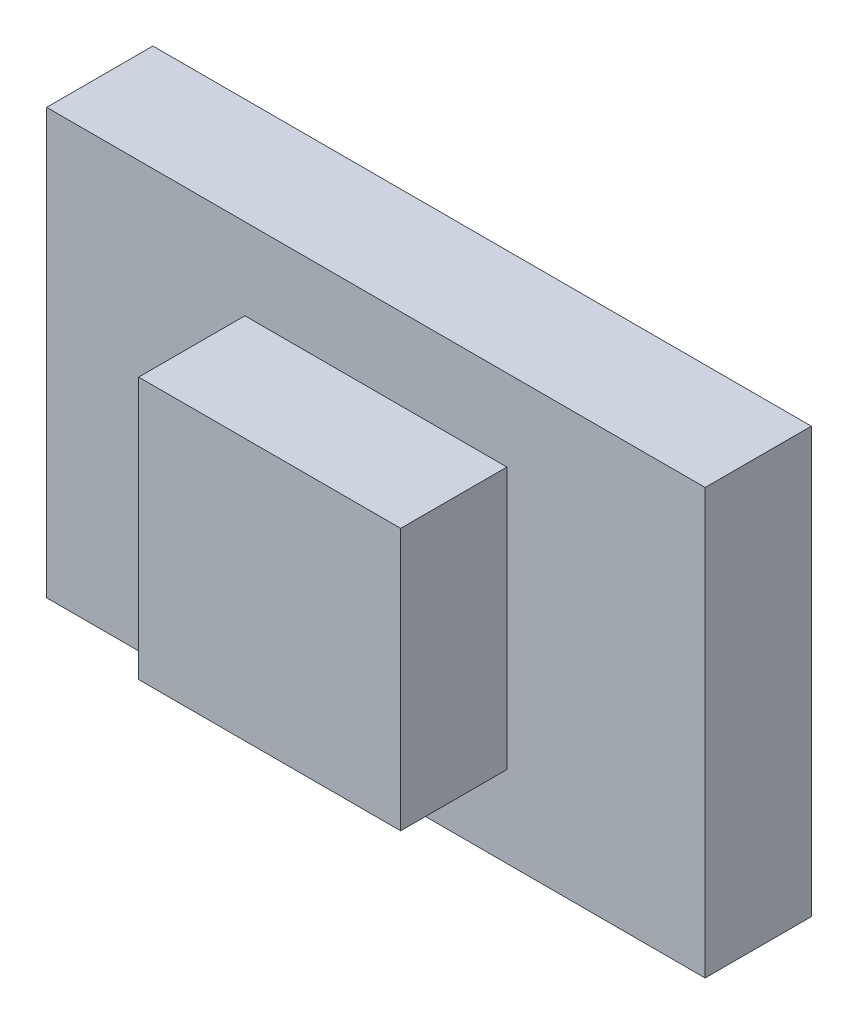
ISO-10303-21;
HEADER;
FILE_DESCRIPTION(('STEP AP214'),'2;1');
FILE_NAME('part.step','',(''),(''),'','','');
FILE_SCHEMA(('AUTOMOTIVE_DESIGN { 1 0 10303 214 1 1 1 1 }'));
ENDSEC;
DATA;
#1=APPLICATION_CONTEXT('core data for automotive mechanical design processes');
#2=APPLICATION_PROTOCOL_DEFINITION('international standard','automotive_design',2000,#1);
#3=PRODUCT_CONTEXT('',#1,'mechanical');
#4=PRODUCT('Part','Part','',(#3));
#5=PRODUCT_RELATED_PRODUCT_CATEGORY('part','',(#4));
#6=PRODUCT_DEFINITION_FORMATION('','',#4);
#7=PRODUCT_DEFINITION_CONTEXT('part definition',#1,'design');
#8=PRODUCT_DEFINITION('design','',#6,#7);
#9=PRODUCT_DEFINITION_SHAPE('','',#8);
#10=(LENGTH_UNIT() NAMED_UNIT(*) SI_UNIT(.MILLI.,.METRE.));
#11=(NAMED_UNIT(*) PLANE_ANGLE_UNIT() SI_UNIT($,.RADIAN.));
#12=(NAMED_UNIT(*) SI_UNIT($,.STERADIAN.) SOLID_ANGLE_UNIT());
#13=UNCERTAINTY_MEASURE_WITH_UNIT(LENGTH_MEASURE(1.E-05),#10,'distance_accuracy_value','');
#14=(GEOMETRIC_REPRESENTATION_CONTEXT(3) GLOBAL_UNCERTAINTY_ASSIGNED_CONTEXT((#13)) GLOBAL_UNIT_ASSIGNED_CONTEXT((#10,
#11,#12)) REPRESENTATION_CONTEXT('',''));
#15=CARTESIAN_POINT('',(0.,0.,0.));
#16=DIRECTION('',(0.,0.,1.));
#17=DIRECTION('',(1.,0.,0.));
#18=AXIS2_PLACEMENT_3D('',#15,#16,#17);
#19=CARTESIAN_POINT('',(46.5,-30.,15.));
#20=DIRECTION('',(0.,1.,0.));
#21=DIRECTION('',(0.,0.,1.));
#22=AXIS2_PLACEMENT_3D('',#19,#20,#21);
#23=PLANE('',#22);
#24=DIRECTION('',(1.,0.,0.));
#25=VECTOR('',#24,1.);
#26=CARTESIAN_POINT('',(46.5,-30.,0.));
#27=LINE('',#26,#25);
#28=CARTESIAN_POINT('',(-46.5,-30.,0.));
#29=VERTEX_POINT('',#28);
#30=CARTESIAN_POINT('',(46.5,-30.,0.));
#31=VERTEX_POINT('',#30);
#32=EDGE_CURVE('E137',#29,#31,#27,.T.);
#33=ORIENTED_EDGE('',*,*,#32,.T.);
#34=DIRECTION('',(0.,0.,-1.));
#35=VECTOR('',#34,1.);
#36=CARTESIAN_POINT('',(46.5,-30.,15.));
#37=LINE('',#36,#35);
#38=CARTESIAN_POINT('',(46.5,-30.,15.));
#39=VERTEX_POINT('',#38);
#40=EDGE_CURVE('E11',#39,#31,#37,.T.);
#41=ORIENTED_EDGE('',*,*,#40,.F.);
#42=DIRECTION('',(1.,0.,0.));
#43=VECTOR('',#42,1.);
#44=CARTESIAN_POINT('',(46.5,-30.,15.));
#45=LINE('',#44,#43);
#46=CARTESIAN_POINT('',(-46.5,-30.,15.));
#47=VERTEX_POINT('',#46);
#48=EDGE_CURVE('E148',#47,#39,#45,.T.);
#49=ORIENTED_EDGE('',*,*,#48,.F.);
#50=DIRECTION('',(0.,0.,-1.));
#51=VECTOR('',#50,1.);
#52=CARTESIAN_POINT('',(-46.5,-30.,15.));
#53=LINE('',#52,#51);
#54=EDGE_CURVE('E161',#47,#29,#53,.T.);
#55=ORIENTED_EDGE('',*,*,#54,.T.);
#56=EDGE_LOOP('',(#33,#41,#49,#55));
#57=FACE_BOUND('',#56,.T.);
#58=ADVANCED_FACE('F49',(#57),#23,.F.);
#59=CARTESIAN_POINT('',(46.5,30.,15.));
#60=DIRECTION('',(-1.,0.,0.));
#61=DIRECTION('',(0.,-1.,0.));
#62=AXIS2_PLACEMENT_3D('',#59,#60,#61);
#63=PLANE('',#62);
#64=DIRECTION('',(0.,1.,0.));
#65=VECTOR('',#64,1.);
#66=CARTESIAN_POINT('',(46.5,30.,0.));
#67=LINE('',#66,#65);
#68=CARTESIAN_POINT('',(46.5,30.,0.));
#69=VERTEX_POINT('',#68);
#70=EDGE_CURVE('E142',#31,#69,#67,.T.);
#71=ORIENTED_EDGE('',*,*,#70,.T.);
#72=DIRECTION('',(0.,0.,-1.));
#73=VECTOR('',#72,1.);
#74=CARTESIAN_POINT('',(46.5,30.,15.));
#75=LINE('',#74,#73);
#76=CARTESIAN_POINT('',(46.5,30.,15.));
#77=VERTEX_POINT('',#76);
#78=EDGE_CURVE('E57',#77,#69,#75,.T.);
#79=ORIENTED_EDGE('',*,*,#78,.F.);
#80=DIRECTION('',(0.,1.,0.));
#81=VECTOR('',#80,1.);
#82=CARTESIAN_POINT('',(46.5,30.,15.));
#83=LINE('',#82,#81);
#84=EDGE_CURVE('E152',#39,#77,#83,.T.);
#85=ORIENTED_EDGE('',*,*,#84,.F.);
#86=ORIENTED_EDGE('',*,*,#40,.T.);
#87=EDGE_LOOP('',(#71,#79,#85,#86));
#88=FACE_BOUND('',#87,.T.);
#89=ADVANCED_FACE('F198',(#88),#63,.F.);
#90=CARTESIAN_POINT('',(46.5,30.,15.));
#91=DIRECTION('',(0.,-1.,0.));
#92=DIRECTION('',(0.,0.,-1.));
#93=AXIS2_PLACEMENT_3D('',#90,#91,#92);
#94=PLANE('',#93);
#95=DIRECTION('',(-1.,0.,0.));
#96=VECTOR('',#95,1.);
#97=CARTESIAN_POINT('',(46.5,30.,0.));
#98=LINE('',#97,#96);
#99=CARTESIAN_POINT('',(-46.5,30.,0.));
#100=VERTEX_POINT('',#99);
#101=EDGE_CURVE('E165',#69,#100,#98,.T.);
#102=ORIENTED_EDGE('',*,*,#101,.T.);
#103=DIRECTION('',(0.,0.,-1.));
#104=VECTOR('',#103,1.);
#105=CARTESIAN_POINT('',(-46.5,30.,15.));
#106=LINE('',#105,#104);
#107=CARTESIAN_POINT('',(-46.5,30.,15.));
#108=VERTEX_POINT('',#107);
#109=EDGE_CURVE('E173',#108,#100,#106,.T.);
#110=ORIENTED_EDGE('',*,*,#109,.F.);
#111=DIRECTION('',(-1.,0.,0.));
#112=VECTOR('',#111,1.);
#113=CARTESIAN_POINT('',(46.5,30.,15.));
#114=LINE('',#113,#112);
#115=EDGE_CURVE('E156',#77,#108,#114,.T.);
#116=ORIENTED_EDGE('',*,*,#115,.F.);
#117=ORIENTED_EDGE('',*,*,#78,.T.);
#118=EDGE_LOOP('',(#102,#110,#116,#117));
#119=FACE_BOUND('',#118,.T.);
#120=ADVANCED_FACE('F182',(#119),#94,.F.);
#121=CARTESIAN_POINT('',(-46.5,30.,15.));
#122=DIRECTION('',(1.,0.,0.));
#123=DIRECTION('',(0.,0.,-1.));
#124=AXIS2_PLACEMENT_3D('',#121,#122,#123);
#125=PLANE('',#124);
#126=DIRECTION('',(0.,-1.,0.));
#127=VECTOR('',#126,1.);
#128=CARTESIAN_POINT('',(-46.5,30.,0.));
#129=LINE('',#128,#127);
#130=EDGE_CURVE('E153',#100,#29,#129,.T.);
#131=ORIENTED_EDGE('',*,*,#130,.T.);
#132=ORIENTED_EDGE('',*,*,#54,.F.);
#133=DIRECTION('',(0.,-1.,0.));
#134=VECTOR('',#133,1.);
#135=CARTESIAN_POINT('',(-46.5,30.,15.));
#136=LINE('',#135,#134);
#137=EDGE_CURVE('E159',#108,#47,#136,.T.);
#138=ORIENTED_EDGE('',*,*,#137,.F.);
#139=ORIENTED_EDGE('',*,*,#109,.T.);
#140=EDGE_LOOP('',(#131,#132,#138,#139));
#141=FACE_BOUND('',#140,.T.);
#142=ADVANCED_FACE('F191',(#141),#125,.F.);
#143=CARTESIAN_POINT('',(0.,0.,15.));
#144=DIRECTION('',(0.,0.,1.));
#145=DIRECTION('',(1.,0.,0.));
#146=AXIS2_PLACEMENT_3D('',#143,#144,#145);
#147=PLANE('',#146);
#148=DIRECTION('',(0.,-1.,0.));
#149=VECTOR('',#148,1.);
#150=CARTESIAN_POINT('',(-18.5,18.5,15.));
#151=LINE('',#150,#149);
#152=CARTESIAN_POINT('',(-18.5,18.5,15.));
#153=VERTEX_POINT('',#152);
#154=CARTESIAN_POINT('',(-18.5,-18.5,15.));
#155=VERTEX_POINT('',#154);
#156=EDGE_CURVE('E64',#153,#155,#151,.T.);
#157=ORIENTED_EDGE('',*,*,#156,.F.);
#158=DIRECTION('',(-1.,0.,0.));
#159=VECTOR('',#158,1.);
#160=CARTESIAN_POINT('',(18.5,18.5,15.));
#161=LINE('',#160,#159);
#162=CARTESIAN_POINT('',(18.5,18.5,15.));
#163=VERTEX_POINT('',#162);
#164=EDGE_CURVE('E68',#163,#153,#161,.T.);
#165=ORIENTED_EDGE('',*,*,#164,.F.);
#166=DIRECTION('',(0.,1.,0.));
#167=VECTOR('',#166,1.);
#168=CARTESIAN_POINT('',(18.5,18.5,15.));
#169=LINE('',#168,#167);
#170=CARTESIAN_POINT('',(18.5,-18.5,15.));
#171=VERTEX_POINT('',#170);
#172=EDGE_CURVE('E313',#171,#163,#169,.T.);
#173=ORIENTED_EDGE('',*,*,#172,.F.);
#174=DIRECTION('',(1.,0.,0.));
#175=VECTOR('',#174,1.);
#176=CARTESIAN_POINT('',(18.5,-18.5,15.));
#177=LINE('',#176,#175);
#178=EDGE_CURVE('E323',#155,#171,#177,.T.);
#179=ORIENTED_EDGE('',*,*,#178,.F.);
#180=EDGE_LOOP('',(#157,#165,#173,#179));
#181=FACE_BOUND('',#180,.T.);
#182=ORIENTED_EDGE('',*,*,#48,.T.);
#183=ORIENTED_EDGE('',*,*,#84,.T.);
#184=ORIENTED_EDGE('',*,*,#115,.T.);
#185=ORIENTED_EDGE('',*,*,#137,.T.);
#186=EDGE_LOOP('',(#182,#183,#184,#185));
#187=FACE_BOUND('',#186,.T.);
#188=ADVANCED_FACE('F197',(#181,#187),#147,.T.);
#189=CARTESIAN_POINT('',(0.,0.,0.));
#190=DIRECTION('',(0.,0.,1.));
#191=DIRECTION('',(1.,0.,0.));
#192=AXIS2_PLACEMENT_3D('',#189,#190,#191);
#193=PLANE('',#192);
#194=ORIENTED_EDGE('',*,*,#32,.F.);
#195=ORIENTED_EDGE('',*,*,#130,.F.);
#196=ORIENTED_EDGE('',*,*,#101,.F.);
#197=ORIENTED_EDGE('',*,*,#70,.F.);
#198=EDGE_LOOP('',(#194,#195,#196,#197));
#199=FACE_BOUND('',#198,.T.);
#200=ADVANCED_FACE('F188',(#199),#193,.F.);
#201=CARTESIAN_POINT('',(-18.5,18.5,30.));
#202=DIRECTION('',(1.,0.,0.));
#203=DIRECTION('',(0.,1.,0.));
#204=AXIS2_PLACEMENT_3D('',#201,#202,#203);
#205=PLANE('',#204);
#206=ORIENTED_EDGE('',*,*,#156,.T.);
#207=DIRECTION('',(0.,0.,-1.));
#208=VECTOR('',#207,1.);
#209=CARTESIAN_POINT('',(-18.5,-18.5,30.));
#210=LINE('',#209,#208);
#211=CARTESIAN_POINT('',(-18.5,-18.5,30.));
#212=VERTEX_POINT('',#211);
#213=EDGE_CURVE('E117',#212,#155,#210,.T.);
#214=ORIENTED_EDGE('',*,*,#213,.F.);
#215=DIRECTION('',(0.,-1.,0.));
#216=VECTOR('',#215,1.);
#217=CARTESIAN_POINT('',(-18.5,18.5,30.));
#218=LINE('',#217,#216);
#219=CARTESIAN_POINT('',(-18.5,18.5,30.));
#220=VERTEX_POINT('',#219);
#221=EDGE_CURVE('E124',#220,#212,#218,.T.);
#222=ORIENTED_EDGE('',*,*,#221,.F.);
#223=DIRECTION('',(0.,0.,-1.));
#224=VECTOR('',#223,1.);
#225=CARTESIAN_POINT('',(-18.5,18.5,30.));
#226=LINE('',#225,#224);
#227=EDGE_CURVE('E310',#220,#153,#226,.T.);
#228=ORIENTED_EDGE('',*,*,#227,.T.);
#229=EDGE_LOOP('',(#206,#214,#222,#228));
#230=FACE_BOUND('',#229,.T.);
#231=ADVANCED_FACE('F135',(#230),#205,.F.);
#232=CARTESIAN_POINT('',(18.5,-18.5,30.));
#233=DIRECTION('',(0.,1.,0.));
#234=DIRECTION('',(-1.,0.,0.));
#235=AXIS2_PLACEMENT_3D('',#232,#233,#234);
#236=PLANE('',#235);
#237=ORIENTED_EDGE('',*,*,#178,.T.);
#238=DIRECTION('',(0.,0.,-1.));
#239=VECTOR('',#238,1.);
#240=CARTESIAN_POINT('',(18.5,-18.5,30.));
#241=LINE('',#240,#239);
#242=CARTESIAN_POINT('',(18.5,-18.5,30.));
#243=VERTEX_POINT('',#242);
#244=EDGE_CURVE('E119',#243,#171,#241,.T.);
#245=ORIENTED_EDGE('',*,*,#244,.F.);
#246=DIRECTION('',(1.,0.,0.));
#247=VECTOR('',#246,1.);
#248=CARTESIAN_POINT('',(18.5,-18.5,30.));
#249=LINE('',#248,#247);
#250=EDGE_CURVE('E112',#212,#243,#249,.T.);
#251=ORIENTED_EDGE('',*,*,#250,.F.);
#252=ORIENTED_EDGE('',*,*,#213,.T.);
#253=EDGE_LOOP('',(#237,#245,#251,#252));
#254=FACE_BOUND('',#253,.T.);
#255=ADVANCED_FACE('F115',(#254),#236,.F.);
#256=CARTESIAN_POINT('',(18.5,18.5,30.));
#257=DIRECTION('',(-1.,0.,0.));
#258=DIRECTION('',(0.,-1.,0.));
#259=AXIS2_PLACEMENT_3D('',#256,#257,#258);
#260=PLANE('',#259);
#261=ORIENTED_EDGE('',*,*,#172,.T.);
#262=DIRECTION('',(0.,0.,-1.));
#263=VECTOR('',#262,1.);
#264=CARTESIAN_POINT('',(18.5,18.5,30.));
#265=LINE('',#264,#263);
#266=CARTESIAN_POINT('',(18.5,18.5,30.));
#267=VERTEX_POINT('',#266);
#268=EDGE_CURVE('E144',#267,#163,#265,.T.);
#269=ORIENTED_EDGE('',*,*,#268,.F.);
#270=DIRECTION('',(0.,1.,0.));
#271=VECTOR('',#270,1.);
#272=CARTESIAN_POINT('',(18.5,18.5,30.));
#273=LINE('',#272,#271);
#274=EDGE_CURVE('E123',#243,#267,#273,.T.);
#275=ORIENTED_EDGE('',*,*,#274,.F.);
#276=ORIENTED_EDGE('',*,*,#244,.T.);
#277=EDGE_LOOP('',(#261,#269,#275,#276));
#278=FACE_BOUND('',#277,.T.);
#279=ADVANCED_FACE('F216',(#278),#260,.F.);
#280=CARTESIAN_POINT('',(18.5,18.5,30.));
#281=DIRECTION('',(0.,-1.,0.));
#282=DIRECTION('',(0.,0.,-1.));
#283=AXIS2_PLACEMENT_3D('',#280,#281,#282);
#284=PLANE('',#283);
#285=ORIENTED_EDGE('',*,*,#164,.T.);
#286=ORIENTED_EDGE('',*,*,#227,.F.);
#287=DIRECTION('',(-1.,0.,0.));
#288=VECTOR('',#287,1.);
#289=CARTESIAN_POINT('',(18.5,18.5,30.));
#290=LINE('',#289,#288);
#291=EDGE_CURVE('E129',#267,#220,#290,.T.);
#292=ORIENTED_EDGE('',*,*,#291,.F.);
#293=ORIENTED_EDGE('',*,*,#268,.T.);
#294=EDGE_LOOP('',(#285,#286,#292,#293));
#295=FACE_BOUND('',#294,.T.);
#296=ADVANCED_FACE('F219',(#295),#284,.F.);
#297=CARTESIAN_POINT('',(0.,0.,30.));
#298=DIRECTION('',(0.,0.,-1.));
#299=DIRECTION('',(-1.,0.,0.));
#300=AXIS2_PLACEMENT_3D('',#297,#298,#299);
#301=PLANE('',#300);
#302=ORIENTED_EDGE('',*,*,#221,.T.);
#303=ORIENTED_EDGE('',*,*,#250,.T.);
#304=ORIENTED_EDGE('',*,*,#274,.T.);
#305=ORIENTED_EDGE('',*,*,#291,.T.);
#306=EDGE_LOOP('',(#302,#303,#304,#305));
#307=FACE_BOUND('',#306,.T.);
#308=ADVANCED_FACE('F127',(#307),#301,.F.);
#309=CLOSED_SHELL('',(#58,#89,#120,#142,#188,#200,#231,#255,#279,#296,#308));
#310=MANIFOLD_SOLID_BREP('B2',#309);
#311=ADVANCED_BREP_SHAPE_REPRESENTATION('',(#18,#310),#14);
#312=SHAPE_DEFINITION_REPRESENTATION(#9,#311);
ENDSEC;
END-ISO-10303-21;
